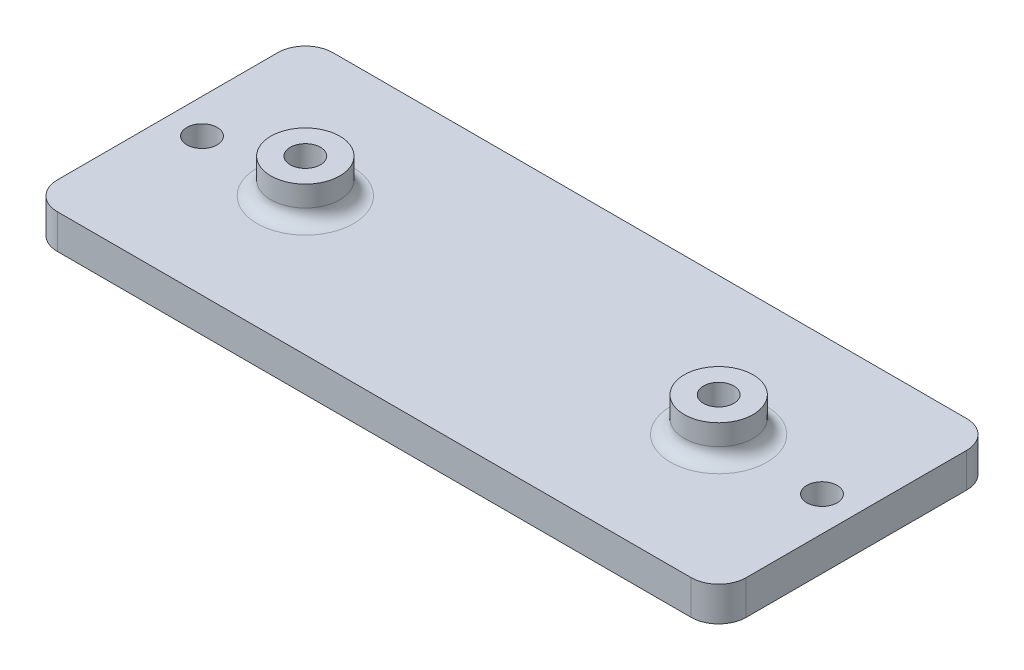
ISO-10303-21;
HEADER;
FILE_DESCRIPTION(('STEP AP214'),'2;1');
FILE_NAME('part.step','',(''),(''),'','','');
FILE_SCHEMA(('AUTOMOTIVE_DESIGN { 1 0 10303 214 1 1 1 1 }'));
ENDSEC;
DATA;
#1=APPLICATION_CONTEXT('core data for automotive mechanical design processes');
#2=APPLICATION_PROTOCOL_DEFINITION('international standard','automotive_design',2000,#1);
#3=PRODUCT_CONTEXT('',#1,'mechanical');
#4=PRODUCT('Part','Part','',(#3));
#5=PRODUCT_RELATED_PRODUCT_CATEGORY('part','',(#4));
#6=PRODUCT_DEFINITION_FORMATION('','',#4);
#7=PRODUCT_DEFINITION_CONTEXT('part definition',#1,'design');
#8=PRODUCT_DEFINITION('design','',#6,#7);
#9=PRODUCT_DEFINITION_SHAPE('','',#8);
#10=(LENGTH_UNIT() NAMED_UNIT(*) SI_UNIT(.MILLI.,.METRE.));
#11=(NAMED_UNIT(*) PLANE_ANGLE_UNIT() SI_UNIT($,.RADIAN.));
#12=(NAMED_UNIT(*) SI_UNIT($,.STERADIAN.) SOLID_ANGLE_UNIT());
#13=UNCERTAINTY_MEASURE_WITH_UNIT(LENGTH_MEASURE(1.E-05),#10,'distance_accuracy_value','');
#14=(GEOMETRIC_REPRESENTATION_CONTEXT(3) GLOBAL_UNCERTAINTY_ASSIGNED_CONTEXT((#13)) GLOBAL_UNIT_ASSIGNED_CONTEXT((#10,
#11,#12)) REPRESENTATION_CONTEXT('',''));
#15=CARTESIAN_POINT('',(0.,0.,0.));
#16=DIRECTION('',(0.,0.,1.));
#17=DIRECTION('',(1.,0.,0.));
#18=AXIS2_PLACEMENT_3D('',#15,#16,#17);
#19=CARTESIAN_POINT('',(-29.21,3.175,10.16));
#20=DIRECTION('',(0.,-1.,0.));
#21=DIRECTION('',(0.,0.,-1.));
#22=AXIS2_PLACEMENT_3D('',#19,#20,#21);
#23=CYLINDRICAL_SURFACE('',#22,2.54);
#24=CARTESIAN_POINT('',(-29.21,0.,10.16));
#25=DIRECTION('',(0.,1.,0.));
#26=DIRECTION('',(0.,0.,-1.));
#27=AXIS2_PLACEMENT_3D('',#24,#25,#26);
#28=CIRCLE('',#27,2.54);
#29=CARTESIAN_POINT('',(-31.75,0.,10.16));
#30=VERTEX_POINT('',#29);
#31=CARTESIAN_POINT('',(-29.21,0.,12.7));
#32=VERTEX_POINT('',#31);
#33=EDGE_CURVE('E131',#30,#32,#28,.T.);
#34=ORIENTED_EDGE('',*,*,#33,.T.);
#35=DIRECTION('',(0.,-1.,0.));
#36=VECTOR('',#35,1.);
#37=CARTESIAN_POINT('',(-29.21,3.175,12.7));
#38=LINE('',#37,#36);
#39=CARTESIAN_POINT('',(-29.21,3.175,12.7));
#40=VERTEX_POINT('',#39);
#41=EDGE_CURVE('E159',#40,#32,#38,.T.);
#42=ORIENTED_EDGE('',*,*,#41,.F.);
#43=CARTESIAN_POINT('',(-29.21,3.175,10.16));
#44=DIRECTION('',(0.,1.,0.));
#45=DIRECTION('',(0.,0.,-1.));
#46=AXIS2_PLACEMENT_3D('',#43,#44,#45);
#47=CIRCLE('',#46,2.54);
#48=CARTESIAN_POINT('',(-31.75,3.175,10.16));
#49=VERTEX_POINT('',#48);
#50=EDGE_CURVE('E146',#49,#40,#47,.T.);
#51=ORIENTED_EDGE('',*,*,#50,.F.);
#52=DIRECTION('',(0.,-1.,0.));
#53=VECTOR('',#52,1.);
#54=CARTESIAN_POINT('',(-31.75,3.175,10.16));
#55=LINE('',#54,#53);
#56=EDGE_CURVE('E127',#49,#30,#55,.T.);
#57=ORIENTED_EDGE('',*,*,#56,.T.);
#58=EDGE_LOOP('',(#34,#42,#51,#57));
#59=FACE_BOUND('',#58,.T.);
#60=ADVANCED_FACE('F33',(#59),#23,.T.);
#61=CARTESIAN_POINT('',(-29.21,3.175,12.7));
#62=DIRECTION('',(0.,0.,-1.));
#63=DIRECTION('',(-1.,0.,0.));
#64=AXIS2_PLACEMENT_3D('',#61,#62,#63);
#65=PLANE('',#64);
#66=DIRECTION('',(1.,0.,0.));
#67=VECTOR('',#66,1.);
#68=CARTESIAN_POINT('',(-29.21,0.,12.7));
#69=LINE('',#68,#67);
#70=CARTESIAN_POINT('',(29.21,0.,12.7));
#71=VERTEX_POINT('',#70);
#72=EDGE_CURVE('E134',#32,#71,#69,.T.);
#73=ORIENTED_EDGE('',*,*,#72,.T.);
#74=DIRECTION('',(0.,-1.,0.));
#75=VECTOR('',#74,1.);
#76=CARTESIAN_POINT('',(29.21,3.175,12.7));
#77=LINE('',#76,#75);
#78=CARTESIAN_POINT('',(29.21,3.175,12.7));
#79=VERTEX_POINT('',#78);
#80=EDGE_CURVE('E156',#79,#71,#77,.T.);
#81=ORIENTED_EDGE('',*,*,#80,.F.);
#82=DIRECTION('',(1.,0.,0.));
#83=VECTOR('',#82,1.);
#84=CARTESIAN_POINT('',(-29.21,3.175,12.7));
#85=LINE('',#84,#83);
#86=EDGE_CURVE('E94',#40,#79,#85,.T.);
#87=ORIENTED_EDGE('',*,*,#86,.F.);
#88=ORIENTED_EDGE('',*,*,#41,.T.);
#89=EDGE_LOOP('',(#73,#81,#87,#88));
#90=FACE_BOUND('',#89,.T.);
#91=ADVANCED_FACE('F232',(#90),#65,.F.);
#92=CARTESIAN_POINT('',(29.21,3.175,10.16));
#93=DIRECTION('',(0.,-1.,0.));
#94=DIRECTION('',(0.,0.,-1.));
#95=AXIS2_PLACEMENT_3D('',#92,#93,#94);
#96=CYLINDRICAL_SURFACE('',#95,2.54);
#97=CARTESIAN_POINT('',(29.21,0.,10.16));
#98=DIRECTION('',(0.,1.,0.));
#99=DIRECTION('',(0.,0.,1.));
#100=AXIS2_PLACEMENT_3D('',#97,#98,#99);
#101=CIRCLE('',#100,2.54);
#102=CARTESIAN_POINT('',(31.75,0.,10.16));
#103=VERTEX_POINT('',#102);
#104=EDGE_CURVE('E137',#71,#103,#101,.T.);
#105=ORIENTED_EDGE('',*,*,#104,.T.);
#106=DIRECTION('',(0.,-1.,0.));
#107=VECTOR('',#106,1.);
#108=CARTESIAN_POINT('',(31.75,3.175,10.16));
#109=LINE('',#108,#107);
#110=CARTESIAN_POINT('',(31.75,3.175,10.16));
#111=VERTEX_POINT('',#110);
#112=EDGE_CURVE('E153',#111,#103,#109,.T.);
#113=ORIENTED_EDGE('',*,*,#112,.F.);
#114=CARTESIAN_POINT('',(29.21,3.175,10.16));
#115=DIRECTION('',(0.,1.,0.));
#116=DIRECTION('',(0.,0.,1.));
#117=AXIS2_PLACEMENT_3D('',#114,#115,#116);
#118=CIRCLE('',#117,2.54);
#119=EDGE_CURVE('E200',#79,#111,#118,.T.);
#120=ORIENTED_EDGE('',*,*,#119,.F.);
#121=ORIENTED_EDGE('',*,*,#80,.T.);
#122=EDGE_LOOP('',(#105,#113,#120,#121));
#123=FACE_BOUND('',#122,.T.);
#124=ADVANCED_FACE('F237',(#123),#96,.T.);
#125=CARTESIAN_POINT('',(31.75,3.175,10.16));
#126=DIRECTION('',(-1.,0.,0.));
#127=DIRECTION('',(0.,0.,1.));
#128=AXIS2_PLACEMENT_3D('',#125,#126,#127);
#129=PLANE('',#128);
#130=DIRECTION('',(0.,0.,-1.));
#131=VECTOR('',#130,1.);
#132=CARTESIAN_POINT('',(31.75,0.,10.16));
#133=LINE('',#132,#131);
#134=CARTESIAN_POINT('',(31.75,0.,-10.16));
#135=VERTEX_POINT('',#134);
#136=EDGE_CURVE('E139',#103,#135,#133,.T.);
#137=ORIENTED_EDGE('',*,*,#136,.T.);
#138=DIRECTION('',(0.,-1.,0.));
#139=VECTOR('',#138,1.);
#140=CARTESIAN_POINT('',(31.75,3.175,-10.16));
#141=LINE('',#140,#139);
#142=CARTESIAN_POINT('',(31.75,3.175,-10.16));
#143=VERTEX_POINT('',#142);
#144=EDGE_CURVE('E150',#143,#135,#141,.T.);
#145=ORIENTED_EDGE('',*,*,#144,.F.);
#146=DIRECTION('',(0.,0.,-1.));
#147=VECTOR('',#146,1.);
#148=CARTESIAN_POINT('',(31.75,3.175,10.16));
#149=LINE('',#148,#147);
#150=EDGE_CURVE('E202',#111,#143,#149,.T.);
#151=ORIENTED_EDGE('',*,*,#150,.F.);
#152=ORIENTED_EDGE('',*,*,#112,.T.);
#153=EDGE_LOOP('',(#137,#145,#151,#152));
#154=FACE_BOUND('',#153,.T.);
#155=ADVANCED_FACE('F208',(#154),#129,.F.);
#156=CARTESIAN_POINT('',(29.21,3.175,-10.16));
#157=DIRECTION('',(0.,-1.,0.));
#158=DIRECTION('',(0.,0.,-1.));
#159=AXIS2_PLACEMENT_3D('',#156,#157,#158);
#160=CYLINDRICAL_SURFACE('',#159,2.54);
#161=CARTESIAN_POINT('',(29.21,0.,-10.16));
#162=DIRECTION('',(0.,1.,0.));
#163=DIRECTION('',(0.,0.,-1.));
#164=AXIS2_PLACEMENT_3D('',#161,#162,#163);
#165=CIRCLE('',#164,2.54);
#166=CARTESIAN_POINT('',(29.21,0.,-12.7));
#167=VERTEX_POINT('',#166);
#168=EDGE_CURVE('E141',#135,#167,#165,.T.);
#169=ORIENTED_EDGE('',*,*,#168,.T.);
#170=DIRECTION('',(0.,-1.,0.));
#171=VECTOR('',#170,1.);
#172=CARTESIAN_POINT('',(29.21,3.175,-12.7));
#173=LINE('',#172,#171);
#174=CARTESIAN_POINT('',(29.21,3.175,-12.7));
#175=VERTEX_POINT('',#174);
#176=EDGE_CURVE('E122',#175,#167,#173,.T.);
#177=ORIENTED_EDGE('',*,*,#176,.F.);
#178=CARTESIAN_POINT('',(29.21,3.175,-10.16));
#179=DIRECTION('',(0.,1.,0.));
#180=DIRECTION('',(0.,0.,-1.));
#181=AXIS2_PLACEMENT_3D('',#178,#179,#180);
#182=CIRCLE('',#181,2.54);
#183=EDGE_CURVE('E113',#143,#175,#182,.T.);
#184=ORIENTED_EDGE('',*,*,#183,.F.);
#185=ORIENTED_EDGE('',*,*,#144,.T.);
#186=EDGE_LOOP('',(#169,#177,#184,#185));
#187=FACE_BOUND('',#186,.T.);
#188=ADVANCED_FACE('F212',(#187),#160,.T.);
#189=CARTESIAN_POINT('',(-29.21,3.175,-12.7));
#190=DIRECTION('',(0.,0.,1.));
#191=DIRECTION('',(1.,0.,0.));
#192=AXIS2_PLACEMENT_3D('',#189,#190,#191);
#193=PLANE('',#192);
#194=DIRECTION('',(-1.,0.,0.));
#195=VECTOR('',#194,1.);
#196=CARTESIAN_POINT('',(-29.21,0.,-12.7));
#197=LINE('',#196,#195);
#198=CARTESIAN_POINT('',(-29.21,0.,-12.7));
#199=VERTEX_POINT('',#198);
#200=EDGE_CURVE('E121',#167,#199,#197,.T.);
#201=ORIENTED_EDGE('',*,*,#200,.T.);
#202=DIRECTION('',(0.,-1.,0.));
#203=VECTOR('',#202,1.);
#204=CARTESIAN_POINT('',(-29.21,3.175,-12.7));
#205=LINE('',#204,#203);
#206=CARTESIAN_POINT('',(-29.21,3.175,-12.7));
#207=VERTEX_POINT('',#206);
#208=EDGE_CURVE('E118',#207,#199,#205,.T.);
#209=ORIENTED_EDGE('',*,*,#208,.F.);
#210=DIRECTION('',(-1.,0.,0.));
#211=VECTOR('',#210,1.);
#212=CARTESIAN_POINT('',(-29.21,3.175,-12.7));
#213=LINE('',#212,#211);
#214=EDGE_CURVE('E107',#175,#207,#213,.T.);
#215=ORIENTED_EDGE('',*,*,#214,.F.);
#216=ORIENTED_EDGE('',*,*,#176,.T.);
#217=EDGE_LOOP('',(#201,#209,#215,#216));
#218=FACE_BOUND('',#217,.T.);
#219=ADVANCED_FACE('F119',(#218),#193,.F.);
#220=CARTESIAN_POINT('',(-29.21,3.175,-10.16));
#221=DIRECTION('',(0.,-1.,0.));
#222=DIRECTION('',(0.,0.,-1.));
#223=AXIS2_PLACEMENT_3D('',#220,#221,#222);
#224=CYLINDRICAL_SURFACE('',#223,2.54);
#225=CARTESIAN_POINT('',(-29.21,0.,-10.16));
#226=DIRECTION('',(0.,1.,0.));
#227=DIRECTION('',(0.,0.,-1.));
#228=AXIS2_PLACEMENT_3D('',#225,#226,#227);
#229=CIRCLE('',#228,2.54);
#230=CARTESIAN_POINT('',(-31.75,0.,-10.16));
#231=VERTEX_POINT('',#230);
#232=EDGE_CURVE('E79',#199,#231,#229,.T.);
#233=ORIENTED_EDGE('',*,*,#232,.T.);
#234=DIRECTION('',(0.,-1.,0.));
#235=VECTOR('',#234,1.);
#236=CARTESIAN_POINT('',(-31.75,3.175,-10.16));
#237=LINE('',#236,#235);
#238=CARTESIAN_POINT('',(-31.75,3.175,-10.16));
#239=VERTEX_POINT('',#238);
#240=EDGE_CURVE('E123',#239,#231,#237,.T.);
#241=ORIENTED_EDGE('',*,*,#240,.F.);
#242=CARTESIAN_POINT('',(-29.21,3.175,-10.16));
#243=DIRECTION('',(0.,1.,0.));
#244=DIRECTION('',(0.,0.,-1.));
#245=AXIS2_PLACEMENT_3D('',#242,#243,#244);
#246=CIRCLE('',#245,2.54);
#247=EDGE_CURVE('E111',#207,#239,#246,.T.);
#248=ORIENTED_EDGE('',*,*,#247,.F.);
#249=ORIENTED_EDGE('',*,*,#208,.T.);
#250=EDGE_LOOP('',(#233,#241,#248,#249));
#251=FACE_BOUND('',#250,.T.);
#252=ADVANCED_FACE('F125',(#251),#224,.T.);
#253=CARTESIAN_POINT('',(-31.75,3.175,10.16));
#254=DIRECTION('',(1.,0.,0.));
#255=DIRECTION('',(0.,0.,-1.));
#256=AXIS2_PLACEMENT_3D('',#253,#254,#255);
#257=PLANE('',#256);
#258=DIRECTION('',(0.,0.,1.));
#259=VECTOR('',#258,1.);
#260=CARTESIAN_POINT('',(-31.75,0.,10.16));
#261=LINE('',#260,#259);
#262=EDGE_CURVE('E85',#231,#30,#261,.T.);
#263=ORIENTED_EDGE('',*,*,#262,.T.);
#264=ORIENTED_EDGE('',*,*,#56,.F.);
#265=DIRECTION('',(0.,0.,1.));
#266=VECTOR('',#265,1.);
#267=CARTESIAN_POINT('',(-31.75,3.175,10.16));
#268=LINE('',#267,#266);
#269=EDGE_CURVE('E50',#239,#49,#268,.T.);
#270=ORIENTED_EDGE('',*,*,#269,.F.);
#271=ORIENTED_EDGE('',*,*,#240,.T.);
#272=EDGE_LOOP('',(#263,#264,#270,#271));
#273=FACE_BOUND('',#272,.T.);
#274=ADVANCED_FACE('F220',(#273),#257,.F.);
#275=CARTESIAN_POINT('',(-29.21,3.175,10.16));
#276=DIRECTION('',(0.,-1.,0.));
#277=DIRECTION('',(0.,0.,-1.));
#278=AXIS2_PLACEMENT_3D('',#275,#276,#277);
#279=PLANE('',#278);
#280=CARTESIAN_POINT('',(-28.575,3.175,0.));
#281=DIRECTION('',(0.,1.,0.));
#282=DIRECTION('',(0.,0.,1.));
#283=AXIS2_PLACEMENT_3D('',#280,#281,#282);
#284=CIRCLE('',#283,1.397);
#285=CARTESIAN_POINT('',(-28.575,3.175,1.397));
#286=VERTEX_POINT('',#285);
#287=EDGE_CURVE('E371',#286,#286,#284,.T.);
#288=ORIENTED_EDGE('',*,*,#287,.F.);
#289=EDGE_LOOP('',(#288));
#290=FACE_BOUND('',#289,.T.);
#291=CARTESIAN_POINT('',(28.575,3.175,0.));
#292=DIRECTION('',(0.,1.,0.));
#293=DIRECTION('',(0.,0.,-1.));
#294=AXIS2_PLACEMENT_3D('',#291,#292,#293);
#295=CIRCLE('',#294,1.397);
#296=CARTESIAN_POINT('',(28.575,3.175,-1.397));
#297=VERTEX_POINT('',#296);
#298=EDGE_CURVE('E375',#297,#297,#295,.T.);
#299=ORIENTED_EDGE('',*,*,#298,.F.);
#300=EDGE_LOOP('',(#299));
#301=FACE_BOUND('',#300,.T.);
#302=CARTESIAN_POINT('',(19.05,3.175,0.));
#303=DIRECTION('',(0.,-1.,0.));
#304=DIRECTION('',(0.,0.,-1.));
#305=AXIS2_PLACEMENT_3D('',#302,#303,#304);
#306=CIRCLE('',#305,4.445);
#307=CARTESIAN_POINT('',(19.05,3.175,-4.445));
#308=VERTEX_POINT('',#307);
#309=EDGE_CURVE('E42',#308,#308,#306,.T.);
#310=ORIENTED_EDGE('',*,*,#309,.T.);
#311=EDGE_LOOP('',(#310));
#312=FACE_BOUND('',#311,.T.);
#313=CARTESIAN_POINT('',(-19.05,3.175,0.));
#314=DIRECTION('',(0.,-1.,0.));
#315=DIRECTION('',(0.,0.,-1.));
#316=AXIS2_PLACEMENT_3D('',#313,#314,#315);
#317=CIRCLE('',#316,4.445);
#318=CARTESIAN_POINT('',(-19.05,3.175,-4.445));
#319=VERTEX_POINT('',#318);
#320=EDGE_CURVE('E164',#319,#319,#317,.T.);
#321=ORIENTED_EDGE('',*,*,#320,.T.);
#322=EDGE_LOOP('',(#321));
#323=FACE_BOUND('',#322,.T.);
#324=ORIENTED_EDGE('',*,*,#50,.T.);
#325=ORIENTED_EDGE('',*,*,#86,.T.);
#326=ORIENTED_EDGE('',*,*,#119,.T.);
#327=ORIENTED_EDGE('',*,*,#150,.T.);
#328=ORIENTED_EDGE('',*,*,#183,.T.);
#329=ORIENTED_EDGE('',*,*,#214,.T.);
#330=ORIENTED_EDGE('',*,*,#247,.T.);
#331=ORIENTED_EDGE('',*,*,#269,.T.);
#332=EDGE_LOOP('',(#324,#325,#326,#327,#328,#329,#330,#331));
#333=FACE_BOUND('',#332,.T.);
#334=ADVANCED_FACE('F109',(#290,#301,#312,#323,#333),#279,.F.);
#335=CARTESIAN_POINT('',(-29.21,0.,10.16));
#336=DIRECTION('',(0.,-1.,0.));
#337=DIRECTION('',(0.,0.,-1.));
#338=AXIS2_PLACEMENT_3D('',#335,#336,#337);
#339=PLANE('',#338);
#340=CARTESIAN_POINT('',(-28.575,0.,0.));
#341=DIRECTION('',(0.,-1.,0.));
#342=DIRECTION('',(0.,0.,-1.));
#343=AXIS2_PLACEMENT_3D('',#340,#341,#342);
#344=CIRCLE('',#343,1.397);
#345=CARTESIAN_POINT('',(-28.575,0.,-1.397));
#346=VERTEX_POINT('',#345);
#347=EDGE_CURVE('E368',#346,#346,#344,.F.);
#348=ORIENTED_EDGE('',*,*,#347,.T.);
#349=EDGE_LOOP('',(#348));
#350=FACE_BOUND('',#349,.T.);
#351=CARTESIAN_POINT('',(28.575,0.,0.));
#352=DIRECTION('',(0.,-1.,0.));
#353=DIRECTION('',(0.,0.,-1.));
#354=AXIS2_PLACEMENT_3D('',#351,#352,#353);
#355=CIRCLE('',#354,1.397);
#356=CARTESIAN_POINT('',(28.575,0.,-1.397));
#357=VERTEX_POINT('',#356);
#358=EDGE_CURVE('E380',#357,#357,#355,.F.);
#359=ORIENTED_EDGE('',*,*,#358,.T.);
#360=EDGE_LOOP('',(#359));
#361=FACE_BOUND('',#360,.T.);
#362=CARTESIAN_POINT('',(-19.05,0.,0.));
#363=DIRECTION('',(0.,1.,0.));
#364=DIRECTION('',(0.,0.,1.));
#365=AXIS2_PLACEMENT_3D('',#362,#363,#364);
#366=CIRCLE('',#365,1.397);
#367=CARTESIAN_POINT('',(-19.05,0.,1.397));
#368=VERTEX_POINT('',#367);
#369=EDGE_CURVE('E187',#368,#368,#366,.T.);
#370=ORIENTED_EDGE('',*,*,#369,.T.);
#371=EDGE_LOOP('',(#370));
#372=FACE_BOUND('',#371,.T.);
#373=CARTESIAN_POINT('',(19.05,0.,0.));
#374=DIRECTION('',(0.,1.,0.));
#375=DIRECTION('',(0.,0.,1.));
#376=AXIS2_PLACEMENT_3D('',#373,#374,#375);
#377=CIRCLE('',#376,1.397);
#378=CARTESIAN_POINT('',(19.05,0.,1.397));
#379=VERTEX_POINT('',#378);
#380=EDGE_CURVE('E374',#379,#379,#377,.T.);
#381=ORIENTED_EDGE('',*,*,#380,.T.);
#382=EDGE_LOOP('',(#381));
#383=FACE_BOUND('',#382,.T.);
#384=ORIENTED_EDGE('',*,*,#33,.F.);
#385=ORIENTED_EDGE('',*,*,#262,.F.);
#386=ORIENTED_EDGE('',*,*,#232,.F.);
#387=ORIENTED_EDGE('',*,*,#200,.F.);
#388=ORIENTED_EDGE('',*,*,#168,.F.);
#389=ORIENTED_EDGE('',*,*,#136,.F.);
#390=ORIENTED_EDGE('',*,*,#104,.F.);
#391=ORIENTED_EDGE('',*,*,#72,.F.);
#392=EDGE_LOOP('',(#384,#385,#386,#387,#388,#389,#390,#391));
#393=FACE_BOUND('',#392,.T.);
#394=ADVANCED_FACE('F215',(#350,#361,#372,#383,#393),#339,.T.);
#395=CARTESIAN_POINT('',(-19.05,6.35,0.));
#396=DIRECTION('',(0.,-1.,0.));
#397=DIRECTION('',(0.,0.,-1.));
#398=AXIS2_PLACEMENT_3D('',#395,#396,#397);
#399=CYLINDRICAL_SURFACE('',#398,3.175);
#400=CARTESIAN_POINT('',(-19.05,4.445,0.));
#401=DIRECTION('',(0.,-1.,0.));
#402=DIRECTION('',(0.,0.,-1.));
#403=AXIS2_PLACEMENT_3D('',#400,#401,#402);
#404=CIRCLE('',#403,3.175);
#405=CARTESIAN_POINT('',(-19.05,4.445,-3.175));
#406=VERTEX_POINT('',#405);
#407=EDGE_CURVE('E11',#406,#406,#404,.F.);
#408=ORIENTED_EDGE('',*,*,#407,.T.);
#409=EDGE_LOOP('',(#408));
#410=FACE_BOUND('',#409,.T.);
#411=CARTESIAN_POINT('',(-19.05,6.35,0.));
#412=DIRECTION('',(0.,1.,0.));
#413=DIRECTION('',(0.,0.,1.));
#414=AXIS2_PLACEMENT_3D('',#411,#412,#413);
#415=CIRCLE('',#414,3.175);
#416=CARTESIAN_POINT('',(-19.05,6.35,3.175));
#417=VERTEX_POINT('',#416);
#418=EDGE_CURVE('E135',#417,#417,#415,.T.);
#419=ORIENTED_EDGE('',*,*,#418,.F.);
#420=EDGE_LOOP('',(#419));
#421=FACE_BOUND('',#420,.T.);
#422=ADVANCED_FACE('F270',(#410,#421),#399,.T.);
#423=CARTESIAN_POINT('',(-19.05,6.35,0.));
#424=DIRECTION('',(0.,1.,0.));
#425=DIRECTION('',(0.,0.,1.));
#426=AXIS2_PLACEMENT_3D('',#423,#424,#425);
#427=PLANE('',#426);
#428=CARTESIAN_POINT('',(-19.05,6.35,0.));
#429=DIRECTION('',(0.,1.,0.));
#430=DIRECTION('',(0.,0.,1.));
#431=AXIS2_PLACEMENT_3D('',#428,#429,#430);
#432=CIRCLE('',#431,1.397);
#433=CARTESIAN_POINT('',(-19.05,6.35,1.397));
#434=VERTEX_POINT('',#433);
#435=EDGE_CURVE('E192',#434,#434,#432,.T.);
#436=ORIENTED_EDGE('',*,*,#435,.F.);
#437=EDGE_LOOP('',(#436));
#438=FACE_BOUND('',#437,.T.);
#439=ORIENTED_EDGE('',*,*,#418,.T.);
#440=EDGE_LOOP('',(#439));
#441=FACE_BOUND('',#440,.T.);
#442=ADVANCED_FACE('F181',(#438,#441),#427,.T.);
#443=CARTESIAN_POINT('',(19.05,6.35,0.));
#444=DIRECTION('',(0.,-1.,0.));
#445=DIRECTION('',(0.,0.,-1.));
#446=AXIS2_PLACEMENT_3D('',#443,#444,#445);
#447=CYLINDRICAL_SURFACE('',#446,3.175);
#448=CARTESIAN_POINT('',(19.05,4.445,0.));
#449=DIRECTION('',(0.,-1.,0.));
#450=DIRECTION('',(0.,0.,-1.));
#451=AXIS2_PLACEMENT_3D('',#448,#449,#450);
#452=CIRCLE('',#451,3.175);
#453=CARTESIAN_POINT('',(19.05,4.445,-3.175));
#454=VERTEX_POINT('',#453);
#455=EDGE_CURVE('E161',#454,#454,#452,.F.);
#456=ORIENTED_EDGE('',*,*,#455,.T.);
#457=EDGE_LOOP('',(#456));
#458=FACE_BOUND('',#457,.T.);
#459=CARTESIAN_POINT('',(19.05,6.35,0.));
#460=DIRECTION('',(0.,1.,0.));
#461=DIRECTION('',(0.,0.,-1.));
#462=AXIS2_PLACEMENT_3D('',#459,#460,#461);
#463=CIRCLE('',#462,3.175);
#464=CARTESIAN_POINT('',(19.05,6.35,-3.175));
#465=VERTEX_POINT('',#464);
#466=EDGE_CURVE('E185',#465,#465,#463,.T.);
#467=ORIENTED_EDGE('',*,*,#466,.F.);
#468=EDGE_LOOP('',(#467));
#469=FACE_BOUND('',#468,.T.);
#470=ADVANCED_FACE('F177',(#458,#469),#447,.T.);
#471=CARTESIAN_POINT('',(19.05,6.35,0.));
#472=DIRECTION('',(0.,-1.,0.));
#473=DIRECTION('',(0.,0.,-1.));
#474=AXIS2_PLACEMENT_3D('',#471,#472,#473);
#475=PLANE('',#474);
#476=CARTESIAN_POINT('',(19.05,6.35,0.));
#477=DIRECTION('',(0.,1.,0.));
#478=DIRECTION('',(0.,0.,1.));
#479=AXIS2_PLACEMENT_3D('',#476,#477,#478);
#480=CIRCLE('',#479,1.397);
#481=CARTESIAN_POINT('',(19.05,6.35,1.397));
#482=VERTEX_POINT('',#481);
#483=EDGE_CURVE('E195',#482,#482,#480,.T.);
#484=ORIENTED_EDGE('',*,*,#483,.F.);
#485=EDGE_LOOP('',(#484));
#486=FACE_BOUND('',#485,.T.);
#487=ORIENTED_EDGE('',*,*,#466,.T.);
#488=EDGE_LOOP('',(#487));
#489=FACE_BOUND('',#488,.T.);
#490=ADVANCED_FACE('F180',(#486,#489),#475,.F.);
#491=CARTESIAN_POINT('',(19.05,0.,0.));
#492=DIRECTION('',(0.,1.,0.));
#493=DIRECTION('',(0.,0.,1.));
#494=AXIS2_PLACEMENT_3D('',#491,#492,#493);
#495=CYLINDRICAL_SURFACE('',#494,1.397);
#496=ORIENTED_EDGE('',*,*,#380,.F.);
#497=EDGE_LOOP('',(#496));
#498=FACE_BOUND('',#497,.T.);
#499=ORIENTED_EDGE('',*,*,#483,.T.);
#500=EDGE_LOOP('',(#499));
#501=FACE_BOUND('',#500,.T.);
#502=ADVANCED_FACE('F283',(#498,#501),#495,.F.);
#503=CARTESIAN_POINT('',(-19.05,0.,0.));
#504=DIRECTION('',(0.,1.,0.));
#505=DIRECTION('',(0.,0.,1.));
#506=AXIS2_PLACEMENT_3D('',#503,#504,#505);
#507=CYLINDRICAL_SURFACE('',#506,1.397);
#508=ORIENTED_EDGE('',*,*,#369,.F.);
#509=EDGE_LOOP('',(#508));
#510=FACE_BOUND('',#509,.T.);
#511=ORIENTED_EDGE('',*,*,#435,.T.);
#512=EDGE_LOOP('',(#511));
#513=FACE_BOUND('',#512,.T.);
#514=ADVANCED_FACE('F174',(#510,#513),#507,.F.);
#515=CARTESIAN_POINT('',(19.05,4.445,0.));
#516=DIRECTION('',(0.,-1.,0.));
#517=DIRECTION('',(0.,0.,-1.));
#518=AXIS2_PLACEMENT_3D('',#515,#516,#517);
#519=TOROIDAL_SURFACE('',#518,4.445,1.27);
#520=ORIENTED_EDGE('',*,*,#309,.F.);
#521=EDGE_LOOP('',(#520));
#522=FACE_BOUND('',#521,.T.);
#523=ORIENTED_EDGE('',*,*,#455,.F.);
#524=EDGE_LOOP('',(#523));
#525=FACE_BOUND('',#524,.T.);
#526=ADVANCED_FACE('F171',(#522,#525),#519,.F.);
#527=CARTESIAN_POINT('',(-19.05,4.445,0.));
#528=DIRECTION('',(0.,-1.,0.));
#529=DIRECTION('',(0.,0.,-1.));
#530=AXIS2_PLACEMENT_3D('',#527,#528,#529);
#531=TOROIDAL_SURFACE('',#530,4.445,1.27);
#532=ORIENTED_EDGE('',*,*,#320,.F.);
#533=EDGE_LOOP('',(#532));
#534=FACE_BOUND('',#533,.T.);
#535=ORIENTED_EDGE('',*,*,#407,.F.);
#536=EDGE_LOOP('',(#535));
#537=FACE_BOUND('',#536,.T.);
#538=ADVANCED_FACE('F35',(#534,#537),#531,.F.);
#539=CARTESIAN_POINT('',(28.575,-0.00100000000000013,0.));
#540=DIRECTION('',(0.,1.,0.));
#541=DIRECTION('',(0.,0.,1.));
#542=AXIS2_PLACEMENT_3D('',#539,#540,#541);
#543=CYLINDRICAL_SURFACE('',#542,1.397);
#544=ORIENTED_EDGE('',*,*,#358,.F.);
#545=EDGE_LOOP('',(#544));
#546=FACE_BOUND('',#545,.T.);
#547=ORIENTED_EDGE('',*,*,#298,.T.);
#548=EDGE_LOOP('',(#547));
#549=FACE_BOUND('',#548,.T.);
#550=ADVANCED_FACE('F331',(#546,#549),#543,.F.);
#551=CARTESIAN_POINT('',(-28.575,-0.00100000000000013,0.));
#552=DIRECTION('',(0.,1.,0.));
#553=DIRECTION('',(0.,0.,1.));
#554=AXIS2_PLACEMENT_3D('',#551,#552,#553);
#555=CYLINDRICAL_SURFACE('',#554,1.397);
#556=ORIENTED_EDGE('',*,*,#347,.F.);
#557=EDGE_LOOP('',(#556));
#558=FACE_BOUND('',#557,.T.);
#559=ORIENTED_EDGE('',*,*,#287,.T.);
#560=EDGE_LOOP('',(#559));
#561=FACE_BOUND('',#560,.T.);
#562=ADVANCED_FACE('F351',(#558,#561),#555,.F.);
#563=CLOSED_SHELL('',(#60,#91,#124,#155,#188,#219,#252,#274,#334,#394,#422,#442,#470,#490,#502,
#514,#526,#538,#550,#562));
#564=MANIFOLD_SOLID_BREP('B2',#563);
#565=ADVANCED_BREP_SHAPE_REPRESENTATION('',(#18,#564),#14);
#566=SHAPE_DEFINITION_REPRESENTATION(#9,#565);
ENDSEC;
END-ISO-10303-21;
